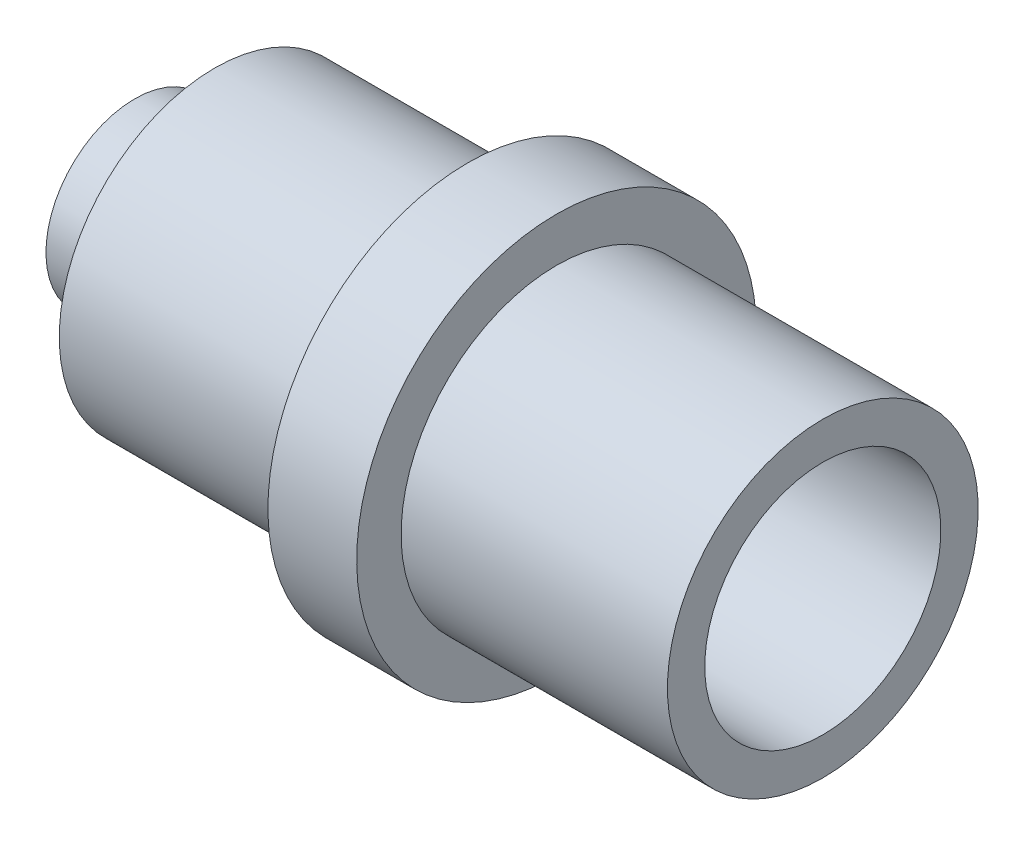
ISO-10303-21;
HEADER;
FILE_DESCRIPTION(('STEP AP214'),'2;1');
FILE_NAME('part.step','',(''),(''),'','','');
FILE_SCHEMA(('AUTOMOTIVE_DESIGN { 1 0 10303 214 1 1 1 1 }'));
ENDSEC;
DATA;
#1=APPLICATION_CONTEXT('core data for automotive mechanical design processes');
#2=APPLICATION_PROTOCOL_DEFINITION('international standard','automotive_design',2000,#1);
#3=PRODUCT_CONTEXT('',#1,'mechanical');
#4=PRODUCT('Part','Part','',(#3));
#5=PRODUCT_RELATED_PRODUCT_CATEGORY('part','',(#4));
#6=PRODUCT_DEFINITION_FORMATION('','',#4);
#7=PRODUCT_DEFINITION_CONTEXT('part definition',#1,'design');
#8=PRODUCT_DEFINITION('design','',#6,#7);
#9=PRODUCT_DEFINITION_SHAPE('','',#8);
#10=(LENGTH_UNIT() NAMED_UNIT(*) SI_UNIT(.MILLI.,.METRE.));
#11=(NAMED_UNIT(*) PLANE_ANGLE_UNIT() SI_UNIT($,.RADIAN.));
#12=(NAMED_UNIT(*) SI_UNIT($,.STERADIAN.) SOLID_ANGLE_UNIT());
#13=UNCERTAINTY_MEASURE_WITH_UNIT(LENGTH_MEASURE(1.E-05),#10,'distance_accuracy_value','');
#14=(GEOMETRIC_REPRESENTATION_CONTEXT(3) GLOBAL_UNCERTAINTY_ASSIGNED_CONTEXT((#13)) GLOBAL_UNIT_ASSIGNED_CONTEXT((#10,
#11,#12)) REPRESENTATION_CONTEXT('',''));
#15=CARTESIAN_POINT('',(0.,0.,0.));
#16=DIRECTION('',(0.,0.,1.));
#17=DIRECTION('',(1.,0.,0.));
#18=AXIS2_PLACEMENT_3D('',#15,#16,#17);
#19=CARTESIAN_POINT('',(0.,0.,0.));
#20=DIRECTION('',(-1.,0.,0.));
#21=DIRECTION('',(0.,-1.,0.));
#22=AXIS2_PLACEMENT_3D('',#19,#20,#21);
#23=PLANE('',#22);
#24=CARTESIAN_POINT('',(0.,0.,0.));
#25=DIRECTION('',(1.,0.,0.));
#26=DIRECTION('',(0.,1.,0.));
#27=AXIS2_PLACEMENT_3D('',#24,#25,#26);
#28=CIRCLE('',#27,2.6596588378658);
#29=CARTESIAN_POINT('',(0.,2.6596588378658,0.));
#30=VERTEX_POINT('',#29);
#31=EDGE_CURVE('E66',#30,#30,#28,.T.);
#32=ORIENTED_EDGE('',*,*,#31,.F.);
#33=EDGE_LOOP('',(#32));
#34=FACE_BOUND('',#33,.T.);
#35=CARTESIAN_POINT('',(0.,0.,0.));
#36=DIRECTION('',(1.,0.,0.));
#37=DIRECTION('',(0.,1.,0.));
#38=AXIS2_PLACEMENT_3D('',#35,#36,#37);
#39=CIRCLE('',#38,3.5);
#40=CARTESIAN_POINT('',(0.,3.5,0.));
#41=VERTEX_POINT('',#40);
#42=EDGE_CURVE('E10',#41,#41,#39,.T.);
#43=ORIENTED_EDGE('',*,*,#42,.T.);
#44=EDGE_LOOP('',(#43));
#45=FACE_BOUND('',#44,.T.);
#46=ADVANCED_FACE('F34',(#34,#45),#23,.F.);
#47=CARTESIAN_POINT('',(0.,0.,0.));
#48=DIRECTION('',(1.,0.,0.));
#49=DIRECTION('',(0.,1.,0.));
#50=AXIS2_PLACEMENT_3D('',#47,#48,#49);
#51=CYLINDRICAL_SURFACE('',#50,3.5);
#52=ORIENTED_EDGE('',*,*,#42,.F.);
#53=EDGE_LOOP('',(#52));
#54=FACE_BOUND('',#53,.T.);
#55=CARTESIAN_POINT('',(-6.,0.,0.));
#56=DIRECTION('',(1.,0.,0.));
#57=DIRECTION('',(0.,1.,0.));
#58=AXIS2_PLACEMENT_3D('',#55,#56,#57);
#59=CIRCLE('',#58,3.5);
#60=CARTESIAN_POINT('',(-6.,3.5,0.));
#61=VERTEX_POINT('',#60);
#62=EDGE_CURVE('E40',#61,#61,#59,.T.);
#63=ORIENTED_EDGE('',*,*,#62,.T.);
#64=EDGE_LOOP('',(#63));
#65=FACE_BOUND('',#64,.T.);
#66=ADVANCED_FACE('F82',(#54,#65),#51,.T.);
#67=CARTESIAN_POINT('',(-6.,-3.5,0.));
#68=DIRECTION('',(-1.,0.,0.));
#69=DIRECTION('',(0.,-1.,0.));
#70=AXIS2_PLACEMENT_3D('',#67,#68,#69);
#71=PLANE('',#70);
#72=ORIENTED_EDGE('',*,*,#62,.F.);
#73=EDGE_LOOP('',(#72));
#74=FACE_BOUND('',#73,.T.);
#75=CARTESIAN_POINT('',(-6.,0.,0.));
#76=DIRECTION('',(1.,0.,0.));
#77=DIRECTION('',(0.,1.,0.));
#78=AXIS2_PLACEMENT_3D('',#75,#76,#77);
#79=CIRCLE('',#78,4.5);
#80=CARTESIAN_POINT('',(-6.,4.5,0.));
#81=VERTEX_POINT('',#80);
#82=EDGE_CURVE('E44',#81,#81,#79,.T.);
#83=ORIENTED_EDGE('',*,*,#82,.T.);
#84=EDGE_LOOP('',(#83));
#85=FACE_BOUND('',#84,.T.);
#86=ADVANCED_FACE('F86',(#74,#85),#71,.F.);
#87=CARTESIAN_POINT('',(0.,0.,0.));
#88=DIRECTION('',(1.,0.,0.));
#89=DIRECTION('',(0.,1.,0.));
#90=AXIS2_PLACEMENT_3D('',#87,#88,#89);
#91=CYLINDRICAL_SURFACE('',#90,4.5);
#92=ORIENTED_EDGE('',*,*,#82,.F.);
#93=EDGE_LOOP('',(#92));
#94=FACE_BOUND('',#93,.T.);
#95=CARTESIAN_POINT('',(-8.,0.,0.));
#96=DIRECTION('',(1.,0.,0.));
#97=DIRECTION('',(0.,1.,0.));
#98=AXIS2_PLACEMENT_3D('',#95,#96,#97);
#99=CIRCLE('',#98,4.5);
#100=CARTESIAN_POINT('',(-8.,4.5,0.));
#101=VERTEX_POINT('',#100);
#102=EDGE_CURVE('E48',#101,#101,#99,.T.);
#103=ORIENTED_EDGE('',*,*,#102,.T.);
#104=EDGE_LOOP('',(#103));
#105=FACE_BOUND('',#104,.T.);
#106=ADVANCED_FACE('F91',(#94,#105),#91,.T.);
#107=CARTESIAN_POINT('',(-8.,-4.5,0.));
#108=DIRECTION('',(1.,0.,0.));
#109=DIRECTION('',(0.,1.,0.));
#110=AXIS2_PLACEMENT_3D('',#107,#108,#109);
#111=PLANE('',#110);
#112=ORIENTED_EDGE('',*,*,#102,.F.);
#113=EDGE_LOOP('',(#112));
#114=FACE_BOUND('',#113,.T.);
#115=CARTESIAN_POINT('',(-8.,0.,0.));
#116=DIRECTION('',(1.,0.,0.));
#117=DIRECTION('',(0.,1.,0.));
#118=AXIS2_PLACEMENT_3D('',#115,#116,#117);
#119=CIRCLE('',#118,3.5);
#120=CARTESIAN_POINT('',(-8.,3.5,0.));
#121=VERTEX_POINT('',#120);
#122=EDGE_CURVE('E53',#121,#121,#119,.T.);
#123=ORIENTED_EDGE('',*,*,#122,.T.);
#124=EDGE_LOOP('',(#123));
#125=FACE_BOUND('',#124,.T.);
#126=ADVANCED_FACE('F97',(#114,#125),#111,.F.);
#127=CARTESIAN_POINT('',(0.,0.,0.));
#128=DIRECTION('',(1.,0.,0.));
#129=DIRECTION('',(0.,1.,0.));
#130=AXIS2_PLACEMENT_3D('',#127,#128,#129);
#131=CYLINDRICAL_SURFACE('',#130,3.5);
#132=ORIENTED_EDGE('',*,*,#122,.F.);
#133=EDGE_LOOP('',(#132));
#134=FACE_BOUND('',#133,.T.);
#135=CARTESIAN_POINT('',(-13.7,0.,0.));
#136=DIRECTION('',(1.,0.,0.));
#137=DIRECTION('',(0.,1.,0.));
#138=AXIS2_PLACEMENT_3D('',#135,#136,#137);
#139=CIRCLE('',#138,3.5);
#140=CARTESIAN_POINT('',(-13.7,3.5,0.));
#141=VERTEX_POINT('',#140);
#142=EDGE_CURVE('E56',#141,#141,#139,.T.);
#143=ORIENTED_EDGE('',*,*,#142,.T.);
#144=EDGE_LOOP('',(#143));
#145=FACE_BOUND('',#144,.T.);
#146=ADVANCED_FACE('F101',(#134,#145),#131,.T.);
#147=CARTESIAN_POINT('',(-13.7,-3.5,0.));
#148=DIRECTION('',(1.,0.,0.));
#149=DIRECTION('',(0.,1.,0.));
#150=AXIS2_PLACEMENT_3D('',#147,#148,#149);
#151=PLANE('',#150);
#152=ORIENTED_EDGE('',*,*,#142,.F.);
#153=EDGE_LOOP('',(#152));
#154=FACE_BOUND('',#153,.T.);
#155=CARTESIAN_POINT('',(-13.7,0.,0.));
#156=DIRECTION('',(1.,0.,0.));
#157=DIRECTION('',(0.,1.,0.));
#158=AXIS2_PLACEMENT_3D('',#155,#156,#157);
#159=CIRCLE('',#158,2.);
#160=CARTESIAN_POINT('',(-13.7,2.,0.));
#161=VERTEX_POINT('',#160);
#162=EDGE_CURVE('E59',#161,#161,#159,.T.);
#163=ORIENTED_EDGE('',*,*,#162,.T.);
#164=EDGE_LOOP('',(#163));
#165=FACE_BOUND('',#164,.T.);
#166=ADVANCED_FACE('F105',(#154,#165),#151,.F.);
#167=CARTESIAN_POINT('',(0.,0.,0.));
#168=DIRECTION('',(1.,0.,0.));
#169=DIRECTION('',(0.,1.,0.));
#170=AXIS2_PLACEMENT_3D('',#167,#168,#169);
#171=CYLINDRICAL_SURFACE('',#170,2.);
#172=ORIENTED_EDGE('',*,*,#162,.F.);
#173=EDGE_LOOP('',(#172));
#174=FACE_BOUND('',#173,.T.);
#175=CARTESIAN_POINT('',(-15.5,0.,0.));
#176=DIRECTION('',(1.,0.,0.));
#177=DIRECTION('',(0.,1.,0.));
#178=AXIS2_PLACEMENT_3D('',#175,#176,#177);
#179=CIRCLE('',#178,2.);
#180=CARTESIAN_POINT('',(-15.5,2.,0.));
#181=VERTEX_POINT('',#180);
#182=EDGE_CURVE('E62',#181,#181,#179,.T.);
#183=ORIENTED_EDGE('',*,*,#182,.T.);
#184=EDGE_LOOP('',(#183));
#185=FACE_BOUND('',#184,.T.);
#186=ADVANCED_FACE('F109',(#174,#185),#171,.T.);
#187=CARTESIAN_POINT('',(-15.5,-2.,0.));
#188=DIRECTION('',(1.,0.,0.));
#189=DIRECTION('',(0.,1.,0.));
#190=AXIS2_PLACEMENT_3D('',#187,#188,#189);
#191=PLANE('',#190);
#192=ORIENTED_EDGE('',*,*,#182,.F.);
#193=EDGE_LOOP('',(#192));
#194=FACE_BOUND('',#193,.T.);
#195=ADVANCED_FACE('F77',(#194),#191,.F.);
#196=CARTESIAN_POINT('',(-5.,0.,0.));
#197=DIRECTION('',(1.,0.,0.));
#198=DIRECTION('',(0.,1.,0.));
#199=AXIS2_PLACEMENT_3D('',#196,#197,#198);
#200=CYLINDRICAL_SURFACE('',#199,2.6596588378658);
#201=CARTESIAN_POINT('',(-5.,0.,0.));
#202=DIRECTION('',(1.,0.,0.));
#203=DIRECTION('',(0.,1.,0.));
#204=AXIS2_PLACEMENT_3D('',#201,#202,#203);
#205=CIRCLE('',#204,2.6596588378658);
#206=CARTESIAN_POINT('',(-5.,2.6596588378658,0.));
#207=VERTEX_POINT('',#206);
#208=EDGE_CURVE('E65',#207,#207,#205,.T.);
#209=ORIENTED_EDGE('',*,*,#208,.F.);
#210=EDGE_LOOP('',(#209));
#211=FACE_BOUND('',#210,.T.);
#212=ORIENTED_EDGE('',*,*,#31,.T.);
#213=EDGE_LOOP('',(#212));
#214=FACE_BOUND('',#213,.T.);
#215=ADVANCED_FACE('F74',(#211,#214),#200,.F.);
#216=CARTESIAN_POINT('',(-5.,0.,0.));
#217=DIRECTION('',(1.,0.,0.));
#218=DIRECTION('',(0.,1.,0.));
#219=AXIS2_PLACEMENT_3D('',#216,#217,#218);
#220=PLANE('',#219);
#221=ORIENTED_EDGE('',*,*,#208,.T.);
#222=EDGE_LOOP('',(#221));
#223=FACE_BOUND('',#222,.T.);
#224=ADVANCED_FACE('F72',(#223),#220,.T.);
#225=CLOSED_SHELL('',(#46,#66,#86,#106,#126,#146,#166,#186,#195,#215,#224));
#226=MANIFOLD_SOLID_BREP('B2',#225);
#227=ADVANCED_BREP_SHAPE_REPRESENTATION('',(#18,#226),#14);
#228=SHAPE_DEFINITION_REPRESENTATION(#9,#227);
ENDSEC;
END-ISO-10303-21;
